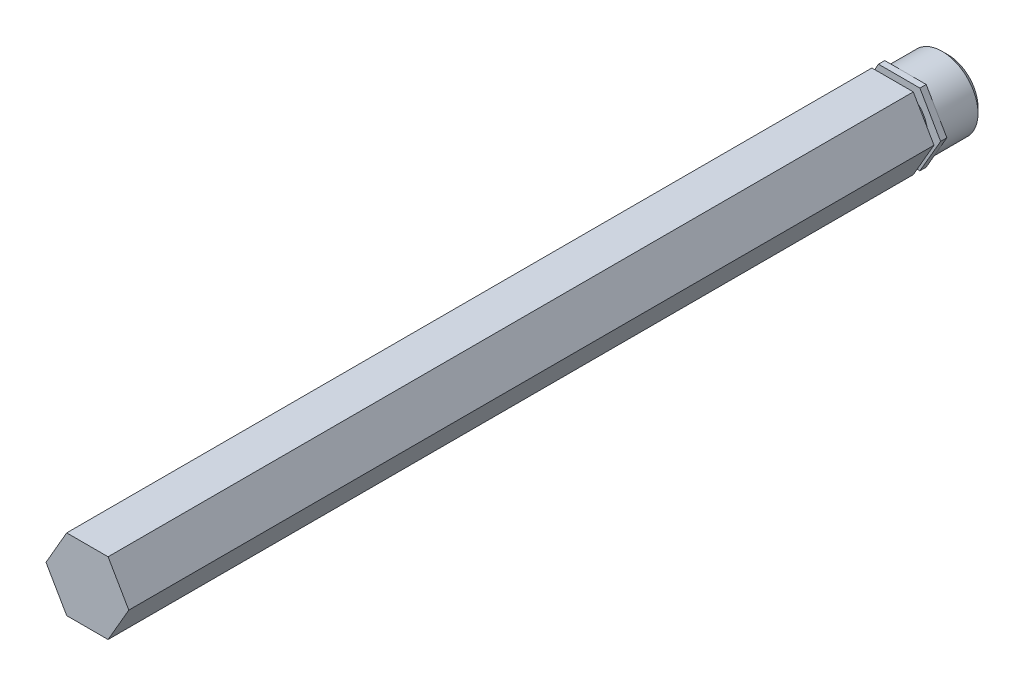
ISO-10303-21;
HEADER;
FILE_DESCRIPTION(('STEP AP214'),'2;1');
FILE_NAME('part.step','',(''),(''),'','','');
FILE_SCHEMA(('AUTOMOTIVE_DESIGN { 1 0 10303 214 1 1 1 1 }'));
ENDSEC;
DATA;
#1=APPLICATION_CONTEXT('core data for automotive mechanical design processes');
#2=APPLICATION_PROTOCOL_DEFINITION('international standard','automotive_design',2000,#1);
#3=PRODUCT_CONTEXT('',#1,'mechanical');
#4=PRODUCT('Part','Part','',(#3));
#5=PRODUCT_RELATED_PRODUCT_CATEGORY('part','',(#4));
#6=PRODUCT_DEFINITION_FORMATION('','',#4);
#7=PRODUCT_DEFINITION_CONTEXT('part definition',#1,'design');
#8=PRODUCT_DEFINITION('design','',#6,#7);
#9=PRODUCT_DEFINITION_SHAPE('','',#8);
#10=(LENGTH_UNIT() NAMED_UNIT(*) SI_UNIT(.MILLI.,.METRE.));
#11=(NAMED_UNIT(*) PLANE_ANGLE_UNIT() SI_UNIT($,.RADIAN.));
#12=(NAMED_UNIT(*) SI_UNIT($,.STERADIAN.) SOLID_ANGLE_UNIT());
#13=UNCERTAINTY_MEASURE_WITH_UNIT(LENGTH_MEASURE(1.E-05),#10,'distance_accuracy_value','');
#14=(GEOMETRIC_REPRESENTATION_CONTEXT(3) GLOBAL_UNCERTAINTY_ASSIGNED_CONTEXT((#13)) GLOBAL_UNIT_ASSIGNED_CONTEXT((#10,
#11,#12)) REPRESENTATION_CONTEXT('',''));
#15=CARTESIAN_POINT('',(0.,0.,0.));
#16=DIRECTION('',(0.,0.,1.));
#17=DIRECTION('',(1.,0.,0.));
#18=AXIS2_PLACEMENT_3D('',#15,#16,#17);
#19=CARTESIAN_POINT('',(7.33234841870824,0.,-76.2));
#20=DIRECTION('',(0.,0.,1.));
#21=DIRECTION('',(1.,0.,0.));
#22=AXIS2_PLACEMENT_3D('',#19,#20,#21);
#23=PLANE('',#22);
#24=CARTESIAN_POINT('',(0.,0.,-76.1999999999716));
#25=DIRECTION('',(0.,0.,1.));
#26=DIRECTION('',(1.,0.,0.));
#27=AXIS2_PLACEMENT_3D('',#24,#25,#26);
#28=CIRCLE('',#27,5.35000000002128);
#29=CARTESIAN_POINT('',(5.35000000002128,0.,-76.1999999999716));
#30=VERTEX_POINT('',#29);
#31=EDGE_CURVE('E20',#30,#30,#28,.T.);
#32=ORIENTED_EDGE('',*,*,#31,.F.);
#33=EDGE_LOOP('',(#32));
#34=FACE_BOUND('',#33,.T.);
#35=ADVANCED_FACE('F17',(#34),#23,.F.);
#36=CARTESIAN_POINT('',(0.,0.,-75.1999999999953));
#37=DIRECTION('',(0.,0.,1.));
#38=DIRECTION('',(1.,0.,0.));
#39=AXIS2_PLACEMENT_3D('',#36,#37,#38);
#40=CONICAL_SURFACE('',#39,6.34999999999764,0.785398163397448);
#41=ORIENTED_EDGE('',*,*,#31,.T.);
#42=EDGE_LOOP('',(#41));
#43=FACE_BOUND('',#42,.T.);
#44=CARTESIAN_POINT('',(0.,0.,-75.2));
#45=DIRECTION('',(0.,0.,-1.));
#46=DIRECTION('',(-1.,0.,0.));
#47=AXIS2_PLACEMENT_3D('',#44,#45,#46);
#48=CIRCLE('',#47,6.35);
#49=CARTESIAN_POINT('',(-6.35,0.,-75.2));
#50=VERTEX_POINT('',#49);
#51=EDGE_CURVE('E134',#50,#50,#48,.F.);
#52=ORIENTED_EDGE('',*,*,#51,.F.);
#53=EDGE_LOOP('',(#52));
#54=FACE_BOUND('',#53,.T.);
#55=ADVANCED_FACE('F529',(#43,#54),#40,.T.);
#56=CARTESIAN_POINT('',(0.,0.,-68.704));
#57=DIRECTION('',(0.,0.,-1.));
#58=DIRECTION('',(-1.,0.,0.));
#59=AXIS2_PLACEMENT_3D('',#56,#57,#58);
#60=CYLINDRICAL_SURFACE('',#59,6.35);
#61=CARTESIAN_POINT('',(0.,0.,-68.704));
#62=DIRECTION('',(0.,0.,-1.));
#63=DIRECTION('',(-1.,0.,0.));
#64=AXIS2_PLACEMENT_3D('',#61,#62,#63);
#65=CIRCLE('',#64,6.35);
#66=CARTESIAN_POINT('',(5.49926131403119,-3.17499999999999,-68.704));
#67=VERTEX_POINT('',#66);
#68=CARTESIAN_POINT('',(5.49926131403118,3.17499999999999,-68.704));
#69=VERTEX_POINT('',#68);
#70=EDGE_CURVE('E121',#67,#69,#65,.F.);
#71=ORIENTED_EDGE('',*,*,#70,.F.);
#72=CARTESIAN_POINT('',(0.,0.,-68.704));
#73=DIRECTION('',(0.,0.,-1.));
#74=DIRECTION('',(-1.,0.,0.));
#75=AXIS2_PLACEMENT_3D('',#72,#73,#74);
#76=CIRCLE('',#75,6.35);
#77=CARTESIAN_POINT('',(0.,-6.35000000000002,-68.704));
#78=VERTEX_POINT('',#77);
#79=EDGE_CURVE('E129',#78,#67,#76,.F.);
#80=ORIENTED_EDGE('',*,*,#79,.F.);
#81=CARTESIAN_POINT('',(0.,0.,-68.704));
#82=DIRECTION('',(0.,0.,-1.));
#83=DIRECTION('',(-1.,0.,0.));
#84=AXIS2_PLACEMENT_3D('',#81,#82,#83);
#85=CIRCLE('',#84,6.35);
#86=CARTESIAN_POINT('',(-5.49926131403119,-3.17500000000001,-68.704));
#87=VERTEX_POINT('',#86);
#88=EDGE_CURVE('E142',#87,#78,#85,.F.);
#89=ORIENTED_EDGE('',*,*,#88,.F.);
#90=CARTESIAN_POINT('',(0.,0.,-68.704));
#91=DIRECTION('',(0.,0.,-1.));
#92=DIRECTION('',(-1.,0.,0.));
#93=AXIS2_PLACEMENT_3D('',#90,#91,#92);
#94=CIRCLE('',#93,6.35);
#95=CARTESIAN_POINT('',(-5.49926131403119,3.175,-68.704));
#96=VERTEX_POINT('',#95);
#97=EDGE_CURVE('E143',#96,#87,#94,.F.);
#98=ORIENTED_EDGE('',*,*,#97,.F.);
#99=CARTESIAN_POINT('',(0.,0.,-68.704));
#100=DIRECTION('',(0.,0.,-1.));
#101=DIRECTION('',(-1.,0.,0.));
#102=AXIS2_PLACEMENT_3D('',#99,#100,#101);
#103=CIRCLE('',#102,6.35);
#104=CARTESIAN_POINT('',(0.,6.35000000000001,-68.704));
#105=VERTEX_POINT('',#104);
#106=EDGE_CURVE('E178',#105,#96,#103,.F.);
#107=ORIENTED_EDGE('',*,*,#106,.F.);
#108=CARTESIAN_POINT('',(0.,0.,-68.704));
#109=DIRECTION('',(0.,0.,-1.));
#110=DIRECTION('',(-1.,0.,0.));
#111=AXIS2_PLACEMENT_3D('',#108,#109,#110);
#112=CIRCLE('',#111,6.35);
#113=EDGE_CURVE('E132',#69,#105,#112,.F.);
#114=ORIENTED_EDGE('',*,*,#113,.F.);
#115=EDGE_LOOP('',(#71,#80,#89,#98,#107,#114));
#116=FACE_BOUND('',#115,.T.);
#117=ORIENTED_EDGE('',*,*,#51,.T.);
#118=EDGE_LOOP('',(#117));
#119=FACE_BOUND('',#118,.T.);
#120=ADVANCED_FACE('F126',(#116,#119),#60,.T.);
#121=CARTESIAN_POINT('',(0.,0.,-68.704));
#122=DIRECTION('',(0.,0.,-1.));
#123=DIRECTION('',(-1.,0.,0.));
#124=AXIS2_PLACEMENT_3D('',#121,#122,#123);
#125=PLANE('',#124);
#126=DIRECTION('',(-0.499999999999999,-0.866025403784439,0.));
#127=VECTOR('',#126,1.);
#128=CARTESIAN_POINT('',(3.6661742093541,-6.35000000000004,-68.704));
#129=LINE('',#128,#127);
#130=CARTESIAN_POINT('',(7.33234841870824,0.,-68.704));
#131=VERTEX_POINT('',#130);
#132=EDGE_CURVE('E149',#131,#67,#129,.T.);
#133=ORIENTED_EDGE('',*,*,#132,.T.);
#134=ORIENTED_EDGE('',*,*,#70,.T.);
#135=DIRECTION('',(0.5,-0.866025403784439,0.));
#136=VECTOR('',#135,1.);
#137=CARTESIAN_POINT('',(7.33234841870824,0.,-68.704));
#138=LINE('',#137,#136);
#139=EDGE_CURVE('E156',#69,#131,#138,.T.);
#140=ORIENTED_EDGE('',*,*,#139,.T.);
#141=EDGE_LOOP('',(#133,#134,#140));
#142=FACE_BOUND('',#141,.T.);
#143=ADVANCED_FACE('F155',(#142),#125,.T.);
#144=CARTESIAN_POINT('',(0.,0.,-68.704));
#145=DIRECTION('',(0.,0.,-1.));
#146=DIRECTION('',(-1.,0.,0.));
#147=AXIS2_PLACEMENT_3D('',#144,#145,#146);
#148=PLANE('',#147);
#149=DIRECTION('',(0.5,-0.866025403784439,0.));
#150=VECTOR('',#149,1.);
#151=CARTESIAN_POINT('',(7.33234841870824,0.,-68.704));
#152=LINE('',#151,#150);
#153=CARTESIAN_POINT('',(3.66617420935411,6.35000000000001,-68.704));
#154=VERTEX_POINT('',#153);
#155=EDGE_CURVE('E153',#154,#69,#152,.T.);
#156=ORIENTED_EDGE('',*,*,#155,.T.);
#157=ORIENTED_EDGE('',*,*,#113,.T.);
#158=DIRECTION('',(1.,0.,0.));
#159=VECTOR('',#158,1.);
#160=CARTESIAN_POINT('',(3.6661742093541,6.35000000000002,-68.704));
#161=LINE('',#160,#159);
#162=EDGE_CURVE('E186',#105,#154,#161,.T.);
#163=ORIENTED_EDGE('',*,*,#162,.T.);
#164=EDGE_LOOP('',(#156,#157,#163));
#165=FACE_BOUND('',#164,.T.);
#166=ADVANCED_FACE('F184',(#165),#148,.T.);
#167=CARTESIAN_POINT('',(0.,0.,-68.704));
#168=DIRECTION('',(0.,0.,-1.));
#169=DIRECTION('',(-1.,0.,0.));
#170=AXIS2_PLACEMENT_3D('',#167,#168,#169);
#171=PLANE('',#170);
#172=ORIENTED_EDGE('',*,*,#106,.T.);
#173=DIRECTION('',(0.5,0.866025403784439,0.));
#174=VECTOR('',#173,1.);
#175=CARTESIAN_POINT('',(-3.66617420935412,6.35000000000002,-68.704));
#176=LINE('',#175,#174);
#177=CARTESIAN_POINT('',(-3.66617420935412,6.35000000000002,-68.704));
#178=VERTEX_POINT('',#177);
#179=EDGE_CURVE('E202',#96,#178,#176,.T.);
#180=ORIENTED_EDGE('',*,*,#179,.T.);
#181=DIRECTION('',(1.,0.,0.));
#182=VECTOR('',#181,1.);
#183=CARTESIAN_POINT('',(3.6661742093541,6.35000000000002,-68.704));
#184=LINE('',#183,#182);
#185=EDGE_CURVE('E195',#178,#105,#184,.T.);
#186=ORIENTED_EDGE('',*,*,#185,.T.);
#187=EDGE_LOOP('',(#172,#180,#186));
#188=FACE_BOUND('',#187,.T.);
#189=ADVANCED_FACE('F201',(#188),#171,.T.);
#190=CARTESIAN_POINT('',(0.,0.,-68.704));
#191=DIRECTION('',(0.,0.,-1.));
#192=DIRECTION('',(-1.,0.,0.));
#193=AXIS2_PLACEMENT_3D('',#190,#191,#192);
#194=PLANE('',#193);
#195=ORIENTED_EDGE('',*,*,#97,.T.);
#196=DIRECTION('',(-0.500000000000001,0.866025403784438,0.));
#197=VECTOR('',#196,1.);
#198=CARTESIAN_POINT('',(-7.33234841870827,0.,-68.704));
#199=LINE('',#198,#197);
#200=CARTESIAN_POINT('',(-7.33234841870827,0.,-68.704));
#201=VERTEX_POINT('',#200);
#202=EDGE_CURVE('E240',#87,#201,#199,.T.);
#203=ORIENTED_EDGE('',*,*,#202,.T.);
#204=DIRECTION('',(0.5,0.866025403784439,0.));
#205=VECTOR('',#204,1.);
#206=CARTESIAN_POINT('',(-3.66617420935412,6.35000000000002,-68.704));
#207=LINE('',#206,#205);
#208=EDGE_CURVE('E214',#201,#96,#207,.T.);
#209=ORIENTED_EDGE('',*,*,#208,.T.);
#210=EDGE_LOOP('',(#195,#203,#209));
#211=FACE_BOUND('',#210,.T.);
#212=ADVANCED_FACE('F488',(#211),#194,.T.);
#213=CARTESIAN_POINT('',(0.,0.,-68.704));
#214=DIRECTION('',(0.,0.,-1.));
#215=DIRECTION('',(-1.,0.,0.));
#216=AXIS2_PLACEMENT_3D('',#213,#214,#215);
#217=PLANE('',#216);
#218=DIRECTION('',(1.,0.,0.));
#219=VECTOR('',#218,1.);
#220=CARTESIAN_POINT('',(-3.66617420935413,-6.35000000000004,-68.704));
#221=LINE('',#220,#219);
#222=CARTESIAN_POINT('',(3.6661742093541,-6.35000000000004,-68.704));
#223=VERTEX_POINT('',#222);
#224=EDGE_CURVE('E141',#223,#78,#221,.F.);
#225=ORIENTED_EDGE('',*,*,#224,.T.);
#226=ORIENTED_EDGE('',*,*,#79,.T.);
#227=DIRECTION('',(-0.499999999999999,-0.866025403784439,0.));
#228=VECTOR('',#227,1.);
#229=CARTESIAN_POINT('',(3.6661742093541,-6.35000000000004,-68.704));
#230=LINE('',#229,#228);
#231=EDGE_CURVE('E139',#67,#223,#230,.T.);
#232=ORIENTED_EDGE('',*,*,#231,.T.);
#233=EDGE_LOOP('',(#225,#226,#232));
#234=FACE_BOUND('',#233,.T.);
#235=ADVANCED_FACE('F138',(#234),#217,.T.);
#236=CARTESIAN_POINT('',(0.,0.,-68.704));
#237=DIRECTION('',(0.,0.,-1.));
#238=DIRECTION('',(-1.,0.,0.));
#239=AXIS2_PLACEMENT_3D('',#236,#237,#238);
#240=PLANE('',#239);
#241=ORIENTED_EDGE('',*,*,#88,.T.);
#242=DIRECTION('',(1.,0.,0.));
#243=VECTOR('',#242,1.);
#244=CARTESIAN_POINT('',(-3.66617420935413,-6.35000000000004,-68.704));
#245=LINE('',#244,#243);
#246=CARTESIAN_POINT('',(-3.66617420935413,-6.35000000000003,-68.704));
#247=VERTEX_POINT('',#246);
#248=EDGE_CURVE('E291',#78,#247,#245,.F.);
#249=ORIENTED_EDGE('',*,*,#248,.T.);
#250=DIRECTION('',(-0.500000000000001,0.866025403784438,0.));
#251=VECTOR('',#250,1.);
#252=CARTESIAN_POINT('',(-7.33234841870827,0.,-68.704));
#253=LINE('',#252,#251);
#254=EDGE_CURVE('E237',#247,#87,#253,.T.);
#255=ORIENTED_EDGE('',*,*,#254,.T.);
#256=EDGE_LOOP('',(#241,#249,#255));
#257=FACE_BOUND('',#256,.T.);
#258=ADVANCED_FACE('F296',(#257),#240,.T.);
#259=CARTESIAN_POINT('',(3.6661742093541,-6.35000000000004,76.2));
#260=DIRECTION('',(-0.866025403784439,0.499999999999999,0.));
#261=DIRECTION('',(-0.499999999999999,-0.866025403784439,0.));
#262=AXIS2_PLACEMENT_3D('',#259,#260,#261);
#263=PLANE('',#262);
#264=DIRECTION('',(0.,0.,1.));
#265=VECTOR('',#264,1.);
#266=CARTESIAN_POINT('',(3.6661742093541,-6.35000000000004,76.2));
#267=LINE('',#266,#265);
#268=CARTESIAN_POINT('',(3.6661742093541,-6.35000000000004,-67.5924));
#269=VERTEX_POINT('',#268);
#270=EDGE_CURVE('E152',#269,#223,#267,.F.);
#271=ORIENTED_EDGE('',*,*,#270,.T.);
#272=ORIENTED_EDGE('',*,*,#231,.F.);
#273=ORIENTED_EDGE('',*,*,#132,.F.);
#274=DIRECTION('',(0.,0.,1.));
#275=VECTOR('',#274,1.);
#276=CARTESIAN_POINT('',(7.33234841870824,0.,76.2));
#277=LINE('',#276,#275);
#278=CARTESIAN_POINT('',(7.33234841870824,0.,-67.5924));
#279=VERTEX_POINT('',#278);
#280=EDGE_CURVE('E203',#131,#279,#277,.T.);
#281=ORIENTED_EDGE('',*,*,#280,.T.);
#282=DIRECTION('',(0.499999999999999,0.866025403784439,0.));
#283=VECTOR('',#282,1.);
#284=CARTESIAN_POINT('',(3.6661742093541,-6.35000000000004,-67.5924));
#285=LINE('',#284,#283);
#286=EDGE_CURVE('E262',#269,#279,#285,.T.);
#287=ORIENTED_EDGE('',*,*,#286,.F.);
#288=EDGE_LOOP('',(#271,#272,#273,#281,#287));
#289=FACE_BOUND('',#288,.T.);
#290=ADVANCED_FACE('F147',(#289),#263,.F.);
#291=CARTESIAN_POINT('',(7.33234841870824,0.,76.2));
#292=DIRECTION('',(-0.866025403784439,-0.5,0.));
#293=DIRECTION('',(0.5,-0.866025403784439,0.));
#294=AXIS2_PLACEMENT_3D('',#291,#292,#293);
#295=PLANE('',#294);
#296=ORIENTED_EDGE('',*,*,#280,.F.);
#297=ORIENTED_EDGE('',*,*,#139,.F.);
#298=ORIENTED_EDGE('',*,*,#155,.F.);
#299=DIRECTION('',(0.,0.,-1.));
#300=VECTOR('',#299,1.);
#301=CARTESIAN_POINT('',(3.6661742093541,6.35000000000002,76.2));
#302=LINE('',#301,#300);
#303=CARTESIAN_POINT('',(3.6661742093541,6.35000000000001,-67.5924));
#304=VERTEX_POINT('',#303);
#305=EDGE_CURVE('E199',#154,#304,#302,.F.);
#306=ORIENTED_EDGE('',*,*,#305,.T.);
#307=DIRECTION('',(-0.5,0.866025403784439,0.));
#308=VECTOR('',#307,1.);
#309=CARTESIAN_POINT('',(7.33234841870824,0.,-67.5924));
#310=LINE('',#309,#308);
#311=EDGE_CURVE('E264',#279,#304,#310,.T.);
#312=ORIENTED_EDGE('',*,*,#311,.F.);
#313=EDGE_LOOP('',(#296,#297,#298,#306,#312));
#314=FACE_BOUND('',#313,.T.);
#315=ADVANCED_FACE('F301',(#314),#295,.F.);
#316=CARTESIAN_POINT('',(3.6661742093541,6.35000000000002,76.2));
#317=DIRECTION('',(0.,-1.,0.));
#318=DIRECTION('',(0.,0.,-1.));
#319=AXIS2_PLACEMENT_3D('',#316,#317,#318);
#320=PLANE('',#319);
#321=ORIENTED_EDGE('',*,*,#305,.F.);
#322=ORIENTED_EDGE('',*,*,#162,.F.);
#323=ORIENTED_EDGE('',*,*,#185,.F.);
#324=DIRECTION('',(0.,0.,1.));
#325=VECTOR('',#324,1.);
#326=CARTESIAN_POINT('',(-3.66617420935412,6.35000000000002,76.2));
#327=LINE('',#326,#325);
#328=CARTESIAN_POINT('',(-3.66617420935412,6.35000000000002,-67.5924));
#329=VERTEX_POINT('',#328);
#330=EDGE_CURVE('E228',#178,#329,#327,.T.);
#331=ORIENTED_EDGE('',*,*,#330,.T.);
#332=DIRECTION('',(1.,0.,0.));
#333=VECTOR('',#332,1.);
#334=CARTESIAN_POINT('',(0.,6.35000000000002,-67.5924));
#335=LINE('',#334,#333);
#336=EDGE_CURVE('E283',#304,#329,#335,.F.);
#337=ORIENTED_EDGE('',*,*,#336,.F.);
#338=EDGE_LOOP('',(#321,#322,#323,#331,#337));
#339=FACE_BOUND('',#338,.T.);
#340=ADVANCED_FACE('F193',(#339),#320,.F.);
#341=CARTESIAN_POINT('',(-3.66617420935412,6.35000000000002,76.2));
#342=DIRECTION('',(0.866025403784439,-0.5,0.));
#343=DIRECTION('',(0.5,0.866025403784439,0.));
#344=AXIS2_PLACEMENT_3D('',#341,#342,#343);
#345=PLANE('',#344);
#346=ORIENTED_EDGE('',*,*,#330,.F.);
#347=ORIENTED_EDGE('',*,*,#179,.F.);
#348=ORIENTED_EDGE('',*,*,#208,.F.);
#349=DIRECTION('',(0.,0.,1.));
#350=VECTOR('',#349,1.);
#351=CARTESIAN_POINT('',(-7.33234841870827,0.,76.2));
#352=LINE('',#351,#350);
#353=CARTESIAN_POINT('',(-7.33234841870827,0.,-67.5924));
#354=VERTEX_POINT('',#353);
#355=EDGE_CURVE('E244',#201,#354,#352,.T.);
#356=ORIENTED_EDGE('',*,*,#355,.T.);
#357=DIRECTION('',(-0.5,-0.866025403784439,0.));
#358=VECTOR('',#357,1.);
#359=CARTESIAN_POINT('',(-3.66617420935412,6.35000000000002,-67.5924));
#360=LINE('',#359,#358);
#361=EDGE_CURVE('E274',#329,#354,#360,.T.);
#362=ORIENTED_EDGE('',*,*,#361,.F.);
#363=EDGE_LOOP('',(#346,#347,#348,#356,#362));
#364=FACE_BOUND('',#363,.T.);
#365=ADVANCED_FACE('F273',(#364),#345,.F.);
#366=CARTESIAN_POINT('',(-7.33234841870827,0.,76.2));
#367=DIRECTION('',(0.866025403784438,0.500000000000001,0.));
#368=DIRECTION('',(-0.500000000000001,0.866025403784438,0.));
#369=AXIS2_PLACEMENT_3D('',#366,#367,#368);
#370=PLANE('',#369);
#371=ORIENTED_EDGE('',*,*,#355,.F.);
#372=ORIENTED_EDGE('',*,*,#202,.F.);
#373=ORIENTED_EDGE('',*,*,#254,.F.);
#374=DIRECTION('',(0.,0.,1.));
#375=VECTOR('',#374,1.);
#376=CARTESIAN_POINT('',(-3.66617420935413,-6.35000000000004,76.2));
#377=LINE('',#376,#375);
#378=CARTESIAN_POINT('',(-3.66617420935413,-6.35000000000004,-67.5924));
#379=VERTEX_POINT('',#378);
#380=EDGE_CURVE('E265',#247,#379,#377,.T.);
#381=ORIENTED_EDGE('',*,*,#380,.T.);
#382=DIRECTION('',(0.500000000000001,-0.866025403784438,0.));
#383=VECTOR('',#382,1.);
#384=CARTESIAN_POINT('',(-7.33234841870827,0.,-67.5924));
#385=LINE('',#384,#383);
#386=EDGE_CURVE('E259',#354,#379,#385,.T.);
#387=ORIENTED_EDGE('',*,*,#386,.F.);
#388=EDGE_LOOP('',(#371,#372,#373,#381,#387));
#389=FACE_BOUND('',#388,.T.);
#390=ADVANCED_FACE('F278',(#389),#370,.F.);
#391=CARTESIAN_POINT('',(-3.66617420935413,-6.35000000000004,76.2));
#392=DIRECTION('',(0.,1.,0.));
#393=DIRECTION('',(0.,0.,1.));
#394=AXIS2_PLACEMENT_3D('',#391,#392,#393);
#395=PLANE('',#394);
#396=ORIENTED_EDGE('',*,*,#380,.F.);
#397=ORIENTED_EDGE('',*,*,#248,.F.);
#398=ORIENTED_EDGE('',*,*,#224,.F.);
#399=ORIENTED_EDGE('',*,*,#270,.F.);
#400=DIRECTION('',(1.,0.,0.));
#401=VECTOR('',#400,1.);
#402=CARTESIAN_POINT('',(0.,-6.35000000000004,-67.5924));
#403=LINE('',#402,#401);
#404=EDGE_CURVE('E175',#379,#269,#403,.T.);
#405=ORIENTED_EDGE('',*,*,#404,.F.);
#406=EDGE_LOOP('',(#396,#397,#398,#399,#405));
#407=FACE_BOUND('',#406,.T.);
#408=ADVANCED_FACE('F298',(#407),#395,.F.);
#409=CARTESIAN_POINT('',(0.,9.67349289505185,-67.5924));
#410=DIRECTION('',(0.,0.,1.));
#411=DIRECTION('',(1.,0.,0.));
#412=AXIS2_PLACEMENT_3D('',#409,#410,#411);
#413=PLANE('',#412);
#414=ORIENTED_EDGE('',*,*,#386,.T.);
#415=ORIENTED_EDGE('',*,*,#404,.T.);
#416=ORIENTED_EDGE('',*,*,#286,.T.);
#417=ORIENTED_EDGE('',*,*,#311,.T.);
#418=ORIENTED_EDGE('',*,*,#336,.T.);
#419=ORIENTED_EDGE('',*,*,#361,.T.);
#420=EDGE_LOOP('',(#414,#415,#416,#417,#418,#419));
#421=FACE_BOUND('',#420,.T.);
#422=CARTESIAN_POINT('',(0.,0.,-67.5924));
#423=DIRECTION('',(0.,0.,1.));
#424=DIRECTION('',(1.,0.,0.));
#425=AXIS2_PLACEMENT_3D('',#422,#423,#424);
#426=CIRCLE('',#425,5.0292);
#427=CARTESIAN_POINT('',(5.0292,0.,-67.5924));
#428=VERTEX_POINT('',#427);
#429=EDGE_CURVE('E172',#428,#428,#426,.T.);
#430=ORIENTED_EDGE('',*,*,#429,.F.);
#431=EDGE_LOOP('',(#430));
#432=FACE_BOUND('',#431,.T.);
#433=ADVANCED_FACE('F299',(#421,#432),#413,.T.);
#434=CARTESIAN_POINT('',(0.,0.,-56.8163271417919));
#435=DIRECTION('',(0.,0.,1.));
#436=DIRECTION('',(1.,0.,0.));
#437=AXIS2_PLACEMENT_3D('',#434,#435,#436);
#438=CYLINDRICAL_SURFACE('',#437,5.0292);
#439=ORIENTED_EDGE('',*,*,#429,.T.);
#440=EDGE_LOOP('',(#439));
#441=FACE_BOUND('',#440,.T.);
#442=CARTESIAN_POINT('',(0.,0.,-66.424));
#443=DIRECTION('',(0.,0.,1.));
#444=DIRECTION('',(1.,0.,0.));
#445=AXIS2_PLACEMENT_3D('',#442,#443,#444);
#446=CIRCLE('',#445,5.0292);
#447=CARTESIAN_POINT('',(5.0292,0.,-66.424));
#448=VERTEX_POINT('',#447);
#449=EDGE_CURVE('E167',#448,#448,#446,.T.);
#450=ORIENTED_EDGE('',*,*,#449,.F.);
#451=EDGE_LOOP('',(#450));
#452=FACE_BOUND('',#451,.T.);
#453=ADVANCED_FACE('F345',(#441,#452),#438,.T.);
#454=CARTESIAN_POINT('',(3.6661742093541,-6.35000000000004,76.2));
#455=DIRECTION('',(-0.866025403784439,0.499999999999999,0.));
#456=DIRECTION('',(-0.499999999999999,-0.866025403784439,0.));
#457=AXIS2_PLACEMENT_3D('',#454,#455,#456);
#458=PLANE('',#457);
#459=DIRECTION('',(0.,0.,1.));
#460=VECTOR('',#459,1.);
#461=CARTESIAN_POINT('',(7.33234841870824,0.,76.2));
#462=LINE('',#461,#460);
#463=CARTESIAN_POINT('',(7.33234841870824,0.,-66.424));
#464=VERTEX_POINT('',#463);
#465=CARTESIAN_POINT('',(7.33234841870824,0.,76.2));
#466=VERTEX_POINT('',#465);
#467=EDGE_CURVE('E569',#464,#466,#462,.T.);
#468=ORIENTED_EDGE('',*,*,#467,.T.);
#469=DIRECTION('',(0.499999999999999,0.866025403784439,0.));
#470=VECTOR('',#469,1.);
#471=CARTESIAN_POINT('',(3.6661742093541,-6.35000000000004,76.2));
#472=LINE('',#471,#470);
#473=CARTESIAN_POINT('',(3.6661742093541,-6.35000000000004,76.2));
#474=VERTEX_POINT('',#473);
#475=EDGE_CURVE('E572',#474,#466,#472,.T.);
#476=ORIENTED_EDGE('',*,*,#475,.F.);
#477=DIRECTION('',(0.,0.,1.));
#478=VECTOR('',#477,1.);
#479=CARTESIAN_POINT('',(3.6661742093541,-6.35000000000004,76.2));
#480=LINE('',#479,#478);
#481=CARTESIAN_POINT('',(3.6661742093541,-6.35000000000004,-66.424));
#482=VERTEX_POINT('',#481);
#483=EDGE_CURVE('E174',#474,#482,#480,.F.);
#484=ORIENTED_EDGE('',*,*,#483,.T.);
#485=DIRECTION('',(-0.499999999999999,-0.866025403784439,0.));
#486=VECTOR('',#485,1.);
#487=CARTESIAN_POINT('',(7.33234841870824,0.,-66.424));
#488=LINE('',#487,#486);
#489=EDGE_CURVE('E170',#464,#482,#488,.T.);
#490=ORIENTED_EDGE('',*,*,#489,.F.);
#491=EDGE_LOOP('',(#468,#476,#484,#490));
#492=FACE_BOUND('',#491,.T.);
#493=ADVANCED_FACE('F341',(#492),#458,.F.);
#494=CARTESIAN_POINT('',(-3.66617420935413,-6.35000000000004,76.2));
#495=DIRECTION('',(0.,1.,0.));
#496=DIRECTION('',(0.,0.,1.));
#497=AXIS2_PLACEMENT_3D('',#494,#495,#496);
#498=PLANE('',#497);
#499=ORIENTED_EDGE('',*,*,#483,.F.);
#500=DIRECTION('',(1.,0.,0.));
#501=VECTOR('',#500,1.);
#502=CARTESIAN_POINT('',(7.33234841870824,-6.35000000000004,76.2));
#503=LINE('',#502,#501);
#504=CARTESIAN_POINT('',(-3.66617420935413,-6.35000000000004,76.2));
#505=VERTEX_POINT('',#504);
#506=EDGE_CURVE('E581',#505,#474,#503,.T.);
#507=ORIENTED_EDGE('',*,*,#506,.F.);
#508=DIRECTION('',(0.,0.,1.));
#509=VECTOR('',#508,1.);
#510=CARTESIAN_POINT('',(-3.66617420935413,-6.35000000000004,76.2));
#511=LINE('',#510,#509);
#512=CARTESIAN_POINT('',(-3.66617420935413,-6.35000000000004,-66.424));
#513=VERTEX_POINT('',#512);
#514=EDGE_CURVE('E171',#505,#513,#511,.F.);
#515=ORIENTED_EDGE('',*,*,#514,.T.);
#516=DIRECTION('',(-1.,0.,0.));
#517=VECTOR('',#516,1.);
#518=CARTESIAN_POINT('',(0.,-6.35000000000004,-66.424));
#519=LINE('',#518,#517);
#520=EDGE_CURVE('E594',#482,#513,#519,.T.);
#521=ORIENTED_EDGE('',*,*,#520,.F.);
#522=EDGE_LOOP('',(#499,#507,#515,#521));
#523=FACE_BOUND('',#522,.T.);
#524=ADVANCED_FACE('F337',(#523),#498,.F.);
#525=CARTESIAN_POINT('',(7.33234841870824,0.,76.2));
#526=DIRECTION('',(-0.866025403784439,-0.5,0.));
#527=DIRECTION('',(0.5,-0.866025403784439,0.));
#528=AXIS2_PLACEMENT_3D('',#525,#526,#527);
#529=PLANE('',#528);
#530=DIRECTION('',(0.,0.,-1.));
#531=VECTOR('',#530,1.);
#532=CARTESIAN_POINT('',(3.6661742093541,6.35000000000002,76.2));
#533=LINE('',#532,#531);
#534=CARTESIAN_POINT('',(3.6661742093541,6.35000000000002,-66.424));
#535=VERTEX_POINT('',#534);
#536=CARTESIAN_POINT('',(3.6661742093541,6.35000000000001,76.2));
#537=VERTEX_POINT('',#536);
#538=EDGE_CURVE('E575',#535,#537,#533,.F.);
#539=ORIENTED_EDGE('',*,*,#538,.T.);
#540=DIRECTION('',(-0.5,0.866025403784439,0.));
#541=VECTOR('',#540,1.);
#542=CARTESIAN_POINT('',(7.33234841870824,0.,76.2));
#543=LINE('',#542,#541);
#544=EDGE_CURVE('E577',#466,#537,#543,.T.);
#545=ORIENTED_EDGE('',*,*,#544,.F.);
#546=ORIENTED_EDGE('',*,*,#467,.F.);
#547=DIRECTION('',(0.5,-0.866025403784439,0.));
#548=VECTOR('',#547,1.);
#549=CARTESIAN_POINT('',(3.6661742093541,6.35000000000002,-66.424));
#550=LINE('',#549,#548);
#551=EDGE_CURVE('E600',#535,#464,#550,.T.);
#552=ORIENTED_EDGE('',*,*,#551,.F.);
#553=EDGE_LOOP('',(#539,#545,#546,#552));
#554=FACE_BOUND('',#553,.T.);
#555=ADVANCED_FACE('F333',(#554),#529,.F.);
#556=CARTESIAN_POINT('',(3.6661742093541,6.35000000000002,76.2));
#557=DIRECTION('',(0.,-1.,0.));
#558=DIRECTION('',(0.,0.,-1.));
#559=AXIS2_PLACEMENT_3D('',#556,#557,#558);
#560=PLANE('',#559);
#561=DIRECTION('',(0.,0.,1.));
#562=VECTOR('',#561,1.);
#563=CARTESIAN_POINT('',(-3.66617420935412,6.35000000000002,76.2));
#564=LINE('',#563,#562);
#565=CARTESIAN_POINT('',(-3.66617420935412,6.35000000000002,-66.424));
#566=VERTEX_POINT('',#565);
#567=CARTESIAN_POINT('',(-3.66617420935412,6.35000000000002,76.2));
#568=VERTEX_POINT('',#567);
#569=EDGE_CURVE('E602',#566,#568,#564,.T.);
#570=ORIENTED_EDGE('',*,*,#569,.T.);
#571=DIRECTION('',(1.,0.,0.));
#572=VECTOR('',#571,1.);
#573=CARTESIAN_POINT('',(7.33234841870824,6.35000000000002,76.2));
#574=LINE('',#573,#572);
#575=EDGE_CURVE('E579',#537,#568,#574,.F.);
#576=ORIENTED_EDGE('',*,*,#575,.F.);
#577=ORIENTED_EDGE('',*,*,#538,.F.);
#578=DIRECTION('',(-1.,0.,0.));
#579=VECTOR('',#578,1.);
#580=CARTESIAN_POINT('',(0.,6.35000000000002,-66.424));
#581=LINE('',#580,#579);
#582=EDGE_CURVE('E597',#566,#535,#581,.F.);
#583=ORIENTED_EDGE('',*,*,#582,.F.);
#584=EDGE_LOOP('',(#570,#576,#577,#583));
#585=FACE_BOUND('',#584,.T.);
#586=ADVANCED_FACE('F329',(#585),#560,.F.);
#587=CARTESIAN_POINT('',(7.33234841870824,0.,76.2));
#588=DIRECTION('',(0.,0.,1.));
#589=DIRECTION('',(1.,0.,0.));
#590=AXIS2_PLACEMENT_3D('',#587,#588,#589);
#591=PLANE('',#590);
#592=DIRECTION('',(-0.500000000000001,0.866025403784438,0.));
#593=VECTOR('',#592,1.);
#594=CARTESIAN_POINT('',(-7.33234841870827,0.,76.2));
#595=LINE('',#594,#593);
#596=CARTESIAN_POINT('',(-7.33234841870827,0.,76.2));
#597=VERTEX_POINT('',#596);
#598=EDGE_CURVE('E588',#597,#505,#595,.F.);
#599=ORIENTED_EDGE('',*,*,#598,.T.);
#600=ORIENTED_EDGE('',*,*,#506,.T.);
#601=ORIENTED_EDGE('',*,*,#475,.T.);
#602=ORIENTED_EDGE('',*,*,#544,.T.);
#603=ORIENTED_EDGE('',*,*,#575,.T.);
#604=DIRECTION('',(0.5,0.866025403784439,0.));
#605=VECTOR('',#604,1.);
#606=CARTESIAN_POINT('',(-3.66617420935412,6.35000000000002,76.2));
#607=LINE('',#606,#605);
#608=EDGE_CURVE('E605',#568,#597,#607,.F.);
#609=ORIENTED_EDGE('',*,*,#608,.T.);
#610=EDGE_LOOP('',(#599,#600,#601,#602,#603,#609));
#611=FACE_BOUND('',#610,.T.);
#612=ADVANCED_FACE('F325',(#611),#591,.T.);
#613=CARTESIAN_POINT('',(-7.33234841870827,0.,76.2));
#614=DIRECTION('',(0.866025403784438,0.500000000000001,0.));
#615=DIRECTION('',(-0.500000000000001,0.866025403784438,0.));
#616=AXIS2_PLACEMENT_3D('',#613,#614,#615);
#617=PLANE('',#616);
#618=ORIENTED_EDGE('',*,*,#514,.F.);
#619=ORIENTED_EDGE('',*,*,#598,.F.);
#620=DIRECTION('',(0.,0.,1.));
#621=VECTOR('',#620,1.);
#622=CARTESIAN_POINT('',(-7.33234841870827,0.,76.2));
#623=LINE('',#622,#621);
#624=CARTESIAN_POINT('',(-7.33234841870827,0.,-66.424));
#625=VERTEX_POINT('',#624);
#626=EDGE_CURVE('E26',#597,#625,#623,.F.);
#627=ORIENTED_EDGE('',*,*,#626,.T.);
#628=DIRECTION('',(-0.500000000000001,0.866025403784438,0.));
#629=VECTOR('',#628,1.);
#630=CARTESIAN_POINT('',(-3.66617420935413,-6.35000000000004,-66.424));
#631=LINE('',#630,#629);
#632=EDGE_CURVE('E34',#513,#625,#631,.T.);
#633=ORIENTED_EDGE('',*,*,#632,.F.);
#634=EDGE_LOOP('',(#618,#619,#627,#633));
#635=FACE_BOUND('',#634,.T.);
#636=ADVANCED_FACE('F319',(#635),#617,.F.);
#637=CARTESIAN_POINT('',(0.,9.67349289505185,-66.424));
#638=DIRECTION('',(0.,0.,-1.));
#639=DIRECTION('',(-1.,0.,0.));
#640=AXIS2_PLACEMENT_3D('',#637,#638,#639);
#641=PLANE('',#640);
#642=ORIENTED_EDGE('',*,*,#582,.T.);
#643=ORIENTED_EDGE('',*,*,#551,.T.);
#644=ORIENTED_EDGE('',*,*,#489,.T.);
#645=ORIENTED_EDGE('',*,*,#520,.T.);
#646=ORIENTED_EDGE('',*,*,#632,.T.);
#647=DIRECTION('',(0.5,0.866025403784439,0.));
#648=VECTOR('',#647,1.);
#649=CARTESIAN_POINT('',(-3.66617420935412,6.35000000000002,-66.424));
#650=LINE('',#649,#648);
#651=EDGE_CURVE('E11',#625,#566,#650,.T.);
#652=ORIENTED_EDGE('',*,*,#651,.T.);
#653=EDGE_LOOP('',(#642,#643,#644,#645,#646,#652));
#654=FACE_BOUND('',#653,.T.);
#655=ORIENTED_EDGE('',*,*,#449,.T.);
#656=EDGE_LOOP('',(#655));
#657=FACE_BOUND('',#656,.T.);
#658=ADVANCED_FACE('F313',(#654,#657),#641,.T.);
#659=CARTESIAN_POINT('',(-3.66617420935412,6.35000000000002,76.2));
#660=DIRECTION('',(0.866025403784439,-0.5,0.));
#661=DIRECTION('',(0.5,0.866025403784439,0.));
#662=AXIS2_PLACEMENT_3D('',#659,#660,#661);
#663=PLANE('',#662);
#664=ORIENTED_EDGE('',*,*,#626,.F.);
#665=ORIENTED_EDGE('',*,*,#608,.F.);
#666=ORIENTED_EDGE('',*,*,#569,.F.);
#667=ORIENTED_EDGE('',*,*,#651,.F.);
#668=EDGE_LOOP('',(#664,#665,#666,#667));
#669=FACE_BOUND('',#668,.T.);
#670=ADVANCED_FACE('F311',(#669),#663,.F.);
#671=CLOSED_SHELL('',(#35,#55,#120,#143,#166,#189,#212,#235,#258,#290,#315,#340,#365,#390,#408,
#433,#453,#493,#524,#555,#586,#612,#636,#658,#670));
#672=MANIFOLD_SOLID_BREP('B1',#671);
#673=ADVANCED_BREP_SHAPE_REPRESENTATION('',(#18,#672),#14);
#674=SHAPE_DEFINITION_REPRESENTATION(#9,#673);
ENDSEC;
END-ISO-10303-21;
